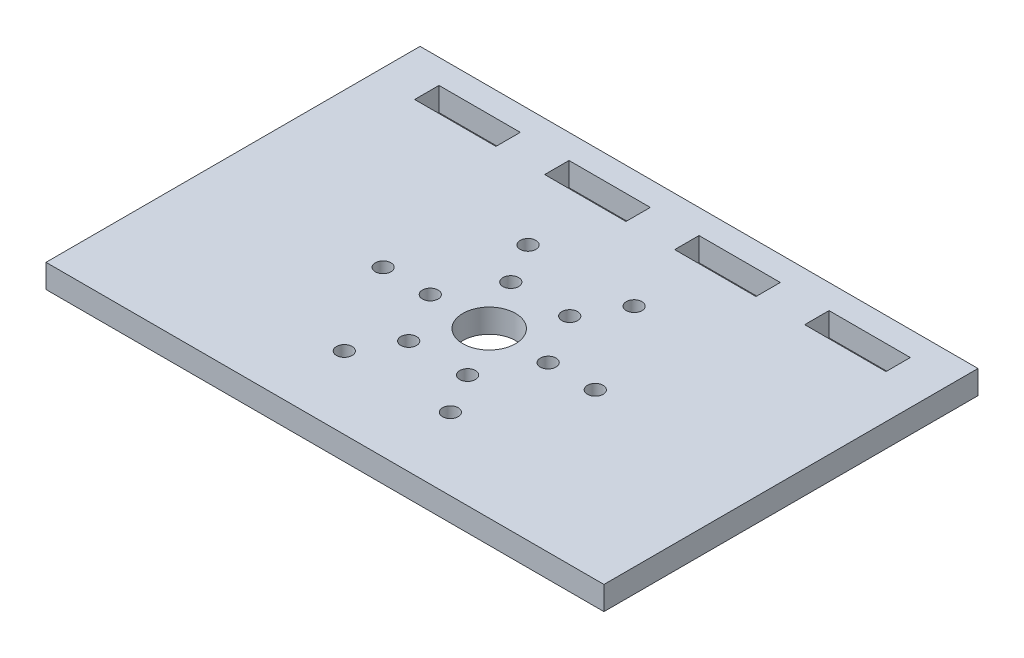
ISO-10303-21;
HEADER;
FILE_DESCRIPTION(('STEP AP214'),'2;1');
FILE_NAME('part.step','',(''),(''),'','','');
FILE_SCHEMA(('AUTOMOTIVE_DESIGN { 1 0 10303 214 1 1 1 1 }'));
ENDSEC;
DATA;
#1=APPLICATION_CONTEXT('core data for automotive mechanical design processes');
#2=APPLICATION_PROTOCOL_DEFINITION('international standard','automotive_design',2000,#1);
#3=PRODUCT_CONTEXT('',#1,'mechanical');
#4=PRODUCT('Part','Part','',(#3));
#5=PRODUCT_RELATED_PRODUCT_CATEGORY('part','',(#4));
#6=PRODUCT_DEFINITION_FORMATION('','',#4);
#7=PRODUCT_DEFINITION_CONTEXT('part definition',#1,'design');
#8=PRODUCT_DEFINITION('design','',#6,#7);
#9=PRODUCT_DEFINITION_SHAPE('','',#8);
#10=(LENGTH_UNIT() NAMED_UNIT(*) SI_UNIT(.MILLI.,.METRE.));
#11=(NAMED_UNIT(*) PLANE_ANGLE_UNIT() SI_UNIT($,.RADIAN.));
#12=(NAMED_UNIT(*) SI_UNIT($,.STERADIAN.) SOLID_ANGLE_UNIT());
#13=UNCERTAINTY_MEASURE_WITH_UNIT(LENGTH_MEASURE(1.E-05),#10,'distance_accuracy_value','');
#14=(GEOMETRIC_REPRESENTATION_CONTEXT(3) GLOBAL_UNCERTAINTY_ASSIGNED_CONTEXT((#13)) GLOBAL_UNIT_ASSIGNED_CONTEXT((#10,
#11,#12)) REPRESENTATION_CONTEXT('',''));
#15=CARTESIAN_POINT('',(0.,0.,0.));
#16=DIRECTION('',(0.,0.,1.));
#17=DIRECTION('',(1.,0.,0.));
#18=AXIS2_PLACEMENT_3D('',#15,#16,#17);
#19=CARTESIAN_POINT('',(0.,3.,-41.4));
#20=DIRECTION('',(0.,0.,1.));
#21=DIRECTION('',(1.,0.,0.));
#22=AXIS2_PLACEMENT_3D('',#19,#20,#21);
#23=PLANE('',#22);
#24=DIRECTION('',(-1.,0.,0.));
#25=VECTOR('',#24,1.);
#26=CARTESIAN_POINT('',(0.,0.,-41.4));
#27=LINE('',#26,#25);
#28=CARTESIAN_POINT('',(65.488,0.,-41.4));
#29=VERTEX_POINT('',#28);
#30=CARTESIAN_POINT('',(55.144,0.,-41.4));
#31=VERTEX_POINT('',#30);
#32=EDGE_CURVE('E283',#29,#31,#27,.T.);
#33=ORIENTED_EDGE('',*,*,#32,.T.);
#34=DIRECTION('',(0.,-1.,0.));
#35=VECTOR('',#34,1.);
#36=CARTESIAN_POINT('',(55.144,3.,-41.4));
#37=LINE('',#36,#35);
#38=CARTESIAN_POINT('',(55.144,3.,-41.4));
#39=VERTEX_POINT('',#38);
#40=EDGE_CURVE('E11',#39,#31,#37,.T.);
#41=ORIENTED_EDGE('',*,*,#40,.F.);
#42=DIRECTION('',(-1.,0.,0.));
#43=VECTOR('',#42,1.);
#44=CARTESIAN_POINT('',(0.,3.,-41.4));
#45=LINE('',#44,#43);
#46=CARTESIAN_POINT('',(65.488,3.,-41.4));
#47=VERTEX_POINT('',#46);
#48=EDGE_CURVE('E188',#47,#39,#45,.T.);
#49=ORIENTED_EDGE('',*,*,#48,.F.);
#50=DIRECTION('',(0.,-1.,0.));
#51=VECTOR('',#50,1.);
#52=CARTESIAN_POINT('',(65.488,3.,-41.4));
#53=LINE('',#52,#51);
#54=EDGE_CURVE('E290',#47,#29,#53,.T.);
#55=ORIENTED_EDGE('',*,*,#54,.T.);
#56=EDGE_LOOP('',(#33,#41,#49,#55));
#57=FACE_BOUND('',#56,.T.);
#58=ADVANCED_FACE('F35',(#57),#23,.F.);
#59=CARTESIAN_POINT('',(55.144,3.,0.));
#60=DIRECTION('',(-1.,0.,0.));
#61=DIRECTION('',(0.,0.,1.));
#62=AXIS2_PLACEMENT_3D('',#59,#60,#61);
#63=PLANE('',#62);
#64=DIRECTION('',(0.,0.,-1.));
#65=VECTOR('',#64,1.);
#66=CARTESIAN_POINT('',(55.144,0.,0.));
#67=LINE('',#66,#65);
#68=CARTESIAN_POINT('',(55.144,0.,-44.5));
#69=VERTEX_POINT('',#68);
#70=EDGE_CURVE('E193',#31,#69,#67,.T.);
#71=ORIENTED_EDGE('',*,*,#70,.T.);
#72=DIRECTION('',(0.,-1.,0.));
#73=VECTOR('',#72,1.);
#74=CARTESIAN_POINT('',(55.144,3.,-44.5));
#75=LINE('',#74,#73);
#76=CARTESIAN_POINT('',(55.144,3.,-44.5));
#77=VERTEX_POINT('',#76);
#78=EDGE_CURVE('E45',#77,#69,#75,.T.);
#79=ORIENTED_EDGE('',*,*,#78,.F.);
#80=DIRECTION('',(0.,0.,-1.));
#81=VECTOR('',#80,1.);
#82=CARTESIAN_POINT('',(55.144,3.,0.));
#83=LINE('',#82,#81);
#84=EDGE_CURVE('E182',#39,#77,#83,.T.);
#85=ORIENTED_EDGE('',*,*,#84,.F.);
#86=ORIENTED_EDGE('',*,*,#40,.T.);
#87=EDGE_LOOP('',(#71,#79,#85,#86));
#88=FACE_BOUND('',#87,.T.);
#89=ADVANCED_FACE('F192',(#88),#63,.F.);
#90=CARTESIAN_POINT('',(0.,3.,-44.5));
#91=DIRECTION('',(0.,0.,-1.));
#92=DIRECTION('',(-1.,0.,0.));
#93=AXIS2_PLACEMENT_3D('',#90,#91,#92);
#94=PLANE('',#93);
#95=DIRECTION('',(1.,0.,0.));
#96=VECTOR('',#95,1.);
#97=CARTESIAN_POINT('',(0.,0.,-44.5));
#98=LINE('',#97,#96);
#99=CARTESIAN_POINT('',(65.488,0.,-44.5));
#100=VERTEX_POINT('',#99);
#101=EDGE_CURVE('E119',#69,#100,#98,.T.);
#102=ORIENTED_EDGE('',*,*,#101,.T.);
#103=DIRECTION('',(0.,-1.,0.));
#104=VECTOR('',#103,1.);
#105=CARTESIAN_POINT('',(65.488,3.,-44.5));
#106=LINE('',#105,#104);
#107=CARTESIAN_POINT('',(65.488,3.,-44.5));
#108=VERTEX_POINT('',#107);
#109=EDGE_CURVE('E194',#108,#100,#106,.T.);
#110=ORIENTED_EDGE('',*,*,#109,.F.);
#111=DIRECTION('',(1.,0.,0.));
#112=VECTOR('',#111,1.);
#113=CARTESIAN_POINT('',(0.,3.,-44.5));
#114=LINE('',#113,#112);
#115=EDGE_CURVE('E186',#77,#108,#114,.T.);
#116=ORIENTED_EDGE('',*,*,#115,.F.);
#117=ORIENTED_EDGE('',*,*,#78,.T.);
#118=EDGE_LOOP('',(#102,#110,#116,#117));
#119=FACE_BOUND('',#118,.T.);
#120=ADVANCED_FACE('F196',(#119),#94,.F.);
#121=CARTESIAN_POINT('',(0.,3.,-41.4));
#122=DIRECTION('',(0.,0.,1.));
#123=DIRECTION('',(1.,0.,0.));
#124=AXIS2_PLACEMENT_3D('',#121,#122,#123);
#125=PLANE('',#124);
#126=DIRECTION('',(-1.,0.,0.));
#127=VECTOR('',#126,1.);
#128=CARTESIAN_POINT('',(0.,0.,-41.4));
#129=LINE('',#128,#127);
#130=CARTESIAN_POINT('',(48.944,0.,-41.4));
#131=VERTEX_POINT('',#130);
#132=CARTESIAN_POINT('',(38.6,0.,-41.4));
#133=VERTEX_POINT('',#132);
#134=EDGE_CURVE('E274',#131,#133,#129,.T.);
#135=ORIENTED_EDGE('',*,*,#134,.T.);
#136=DIRECTION('',(0.,-1.,0.));
#137=VECTOR('',#136,1.);
#138=CARTESIAN_POINT('',(38.6,3.,-41.4));
#139=LINE('',#138,#137);
#140=CARTESIAN_POINT('',(38.6,3.,-41.4));
#141=VERTEX_POINT('',#140);
#142=EDGE_CURVE('E292',#141,#133,#139,.T.);
#143=ORIENTED_EDGE('',*,*,#142,.F.);
#144=DIRECTION('',(-1.,0.,0.));
#145=VECTOR('',#144,1.);
#146=CARTESIAN_POINT('',(0.,3.,-41.4));
#147=LINE('',#146,#145);
#148=CARTESIAN_POINT('',(48.944,3.,-41.4));
#149=VERTEX_POINT('',#148);
#150=EDGE_CURVE('E745',#149,#141,#147,.T.);
#151=ORIENTED_EDGE('',*,*,#150,.F.);
#152=DIRECTION('',(0.,-1.,0.));
#153=VECTOR('',#152,1.);
#154=CARTESIAN_POINT('',(48.944,3.,-41.4));
#155=LINE('',#154,#153);
#156=EDGE_CURVE('E294',#149,#131,#155,.T.);
#157=ORIENTED_EDGE('',*,*,#156,.T.);
#158=EDGE_LOOP('',(#135,#143,#151,#157));
#159=FACE_BOUND('',#158,.T.);
#160=ADVANCED_FACE('F376',(#159),#125,.F.);
#161=CARTESIAN_POINT('',(38.6,3.,0.));
#162=DIRECTION('',(-1.,0.,0.));
#163=DIRECTION('',(0.,0.,1.));
#164=AXIS2_PLACEMENT_3D('',#161,#162,#163);
#165=PLANE('',#164);
#166=DIRECTION('',(0.,0.,-1.));
#167=VECTOR('',#166,1.);
#168=CARTESIAN_POINT('',(38.6,0.,0.));
#169=LINE('',#168,#167);
#170=CARTESIAN_POINT('',(38.6,0.,-44.5));
#171=VERTEX_POINT('',#170);
#172=EDGE_CURVE('E277',#133,#171,#169,.T.);
#173=ORIENTED_EDGE('',*,*,#172,.T.);
#174=DIRECTION('',(0.,-1.,0.));
#175=VECTOR('',#174,1.);
#176=CARTESIAN_POINT('',(38.6,3.,-44.5));
#177=LINE('',#176,#175);
#178=CARTESIAN_POINT('',(38.6,3.,-44.5));
#179=VERTEX_POINT('',#178);
#180=EDGE_CURVE('E301',#179,#171,#177,.T.);
#181=ORIENTED_EDGE('',*,*,#180,.F.);
#182=DIRECTION('',(0.,0.,-1.));
#183=VECTOR('',#182,1.);
#184=CARTESIAN_POINT('',(38.6,3.,0.));
#185=LINE('',#184,#183);
#186=EDGE_CURVE('E747',#141,#179,#185,.T.);
#187=ORIENTED_EDGE('',*,*,#186,.F.);
#188=ORIENTED_EDGE('',*,*,#142,.T.);
#189=EDGE_LOOP('',(#173,#181,#187,#188));
#190=FACE_BOUND('',#189,.T.);
#191=ADVANCED_FACE('F372',(#190),#165,.F.);
#192=CARTESIAN_POINT('',(0.,3.,-44.5));
#193=DIRECTION('',(0.,0.,-1.));
#194=DIRECTION('',(-1.,0.,0.));
#195=AXIS2_PLACEMENT_3D('',#192,#193,#194);
#196=PLANE('',#195);
#197=DIRECTION('',(1.,0.,0.));
#198=VECTOR('',#197,1.);
#199=CARTESIAN_POINT('',(0.,0.,-44.5));
#200=LINE('',#199,#198);
#201=CARTESIAN_POINT('',(48.944,0.,-44.5));
#202=VERTEX_POINT('',#201);
#203=EDGE_CURVE('E279',#171,#202,#200,.T.);
#204=ORIENTED_EDGE('',*,*,#203,.T.);
#205=DIRECTION('',(0.,-1.,0.));
#206=VECTOR('',#205,1.);
#207=CARTESIAN_POINT('',(48.944,3.,-44.5));
#208=LINE('',#207,#206);
#209=CARTESIAN_POINT('',(48.944,3.,-44.5));
#210=VERTEX_POINT('',#209);
#211=EDGE_CURVE('E297',#210,#202,#208,.T.);
#212=ORIENTED_EDGE('',*,*,#211,.F.);
#213=DIRECTION('',(1.,0.,0.));
#214=VECTOR('',#213,1.);
#215=CARTESIAN_POINT('',(0.,3.,-44.5));
#216=LINE('',#215,#214);
#217=EDGE_CURVE('E756',#179,#210,#216,.T.);
#218=ORIENTED_EDGE('',*,*,#217,.F.);
#219=ORIENTED_EDGE('',*,*,#180,.T.);
#220=EDGE_LOOP('',(#204,#212,#218,#219));
#221=FACE_BOUND('',#220,.T.);
#222=ADVANCED_FACE('F368',(#221),#196,.F.);
#223=CARTESIAN_POINT('',(0.,3.,-47.6));
#224=DIRECTION('',(0.,0.,1.));
#225=DIRECTION('',(1.,0.,0.));
#226=AXIS2_PLACEMENT_3D('',#223,#224,#225);
#227=PLANE('',#226);
#228=DIRECTION('',(-1.,0.,0.));
#229=VECTOR('',#228,1.);
#230=CARTESIAN_POINT('',(0.,0.,-47.6));
#231=LINE('',#230,#229);
#232=CARTESIAN_POINT('',(71.,0.,-47.6));
#233=VERTEX_POINT('',#232);
#234=CARTESIAN_POINT('',(0.,0.,-47.6));
#235=VERTEX_POINT('',#234);
#236=EDGE_CURVE('E265',#233,#235,#231,.T.);
#237=ORIENTED_EDGE('',*,*,#236,.T.);
#238=DIRECTION('',(0.,-1.,0.));
#239=VECTOR('',#238,1.);
#240=CARTESIAN_POINT('',(0.,3.,-47.6));
#241=LINE('',#240,#239);
#242=CARTESIAN_POINT('',(0.,3.,-47.6));
#243=VERTEX_POINT('',#242);
#244=EDGE_CURVE('E298',#243,#235,#241,.T.);
#245=ORIENTED_EDGE('',*,*,#244,.F.);
#246=DIRECTION('',(-1.,0.,0.));
#247=VECTOR('',#246,1.);
#248=CARTESIAN_POINT('',(0.,3.,-47.6));
#249=LINE('',#248,#247);
#250=CARTESIAN_POINT('',(71.,3.,-47.6));
#251=VERTEX_POINT('',#250);
#252=EDGE_CURVE('E741',#251,#243,#249,.T.);
#253=ORIENTED_EDGE('',*,*,#252,.F.);
#254=DIRECTION('',(0.,-1.,0.));
#255=VECTOR('',#254,1.);
#256=CARTESIAN_POINT('',(71.,3.,-47.6));
#257=LINE('',#256,#255);
#258=EDGE_CURVE('E306',#251,#233,#257,.T.);
#259=ORIENTED_EDGE('',*,*,#258,.T.);
#260=EDGE_LOOP('',(#237,#245,#253,#259));
#261=FACE_BOUND('',#260,.T.);
#262=ADVANCED_FACE('F371',(#261),#227,.F.);
#263=CARTESIAN_POINT('',(0.,3.,0.));
#264=DIRECTION('',(1.,0.,0.));
#265=DIRECTION('',(0.,0.,-1.));
#266=AXIS2_PLACEMENT_3D('',#263,#264,#265);
#267=PLANE('',#266);
#268=DIRECTION('',(0.,0.,1.));
#269=VECTOR('',#268,1.);
#270=CARTESIAN_POINT('',(0.,0.,0.));
#271=LINE('',#270,#269);
#272=CARTESIAN_POINT('',(0.,0.,0.));
#273=VERTEX_POINT('',#272);
#274=EDGE_CURVE('E268',#235,#273,#271,.T.);
#275=ORIENTED_EDGE('',*,*,#274,.T.);
#276=DIRECTION('',(0.,-1.,0.));
#277=VECTOR('',#276,1.);
#278=CARTESIAN_POINT('',(0.,3.,0.));
#279=LINE('',#278,#277);
#280=CARTESIAN_POINT('',(0.,3.,0.));
#281=VERTEX_POINT('',#280);
#282=EDGE_CURVE('E313',#281,#273,#279,.T.);
#283=ORIENTED_EDGE('',*,*,#282,.F.);
#284=DIRECTION('',(0.,0.,1.));
#285=VECTOR('',#284,1.);
#286=CARTESIAN_POINT('',(0.,3.,0.));
#287=LINE('',#286,#285);
#288=EDGE_CURVE('E764',#243,#281,#287,.T.);
#289=ORIENTED_EDGE('',*,*,#288,.F.);
#290=ORIENTED_EDGE('',*,*,#244,.T.);
#291=EDGE_LOOP('',(#275,#283,#289,#290));
#292=FACE_BOUND('',#291,.T.);
#293=ADVANCED_FACE('F389',(#292),#267,.F.);
#294=CARTESIAN_POINT('',(0.,3.,0.));
#295=DIRECTION('',(0.,0.,-1.));
#296=DIRECTION('',(-1.,0.,0.));
#297=AXIS2_PLACEMENT_3D('',#294,#295,#296);
#298=PLANE('',#297);
#299=DIRECTION('',(1.,0.,0.));
#300=VECTOR('',#299,1.);
#301=CARTESIAN_POINT('',(0.,0.,0.));
#302=LINE('',#301,#300);
#303=CARTESIAN_POINT('',(71.,0.,0.));
#304=VERTEX_POINT('',#303);
#305=EDGE_CURVE('E270',#273,#304,#302,.T.);
#306=ORIENTED_EDGE('',*,*,#305,.T.);
#307=DIRECTION('',(0.,-1.,0.));
#308=VECTOR('',#307,1.);
#309=CARTESIAN_POINT('',(71.,3.,0.));
#310=LINE('',#309,#308);
#311=CARTESIAN_POINT('',(71.,3.,0.));
#312=VERTEX_POINT('',#311);
#313=EDGE_CURVE('E309',#312,#304,#310,.T.);
#314=ORIENTED_EDGE('',*,*,#313,.F.);
#315=DIRECTION('',(1.,0.,0.));
#316=VECTOR('',#315,1.);
#317=CARTESIAN_POINT('',(0.,3.,0.));
#318=LINE('',#317,#316);
#319=EDGE_CURVE('E762',#281,#312,#318,.T.);
#320=ORIENTED_EDGE('',*,*,#319,.F.);
#321=ORIENTED_EDGE('',*,*,#282,.T.);
#322=EDGE_LOOP('',(#306,#314,#320,#321));
#323=FACE_BOUND('',#322,.T.);
#324=ADVANCED_FACE('F385',(#323),#298,.F.);
#325=CARTESIAN_POINT('',(32.4,3.,0.));
#326=DIRECTION('',(-1.,0.,0.));
#327=DIRECTION('',(0.,0.,1.));
#328=AXIS2_PLACEMENT_3D('',#325,#326,#327);
#329=PLANE('',#328);
#330=DIRECTION('',(0.,0.,-1.));
#331=VECTOR('',#330,1.);
#332=CARTESIAN_POINT('',(32.4,0.,0.));
#333=LINE('',#332,#331);
#334=CARTESIAN_POINT('',(32.4,0.,-41.4));
#335=VERTEX_POINT('',#334);
#336=CARTESIAN_POINT('',(32.4,0.,-44.5));
#337=VERTEX_POINT('',#336);
#338=EDGE_CURVE('E253',#335,#337,#333,.T.);
#339=ORIENTED_EDGE('',*,*,#338,.F.);
#340=DIRECTION('',(0.,-1.,0.));
#341=VECTOR('',#340,1.);
#342=CARTESIAN_POINT('',(32.4,3.,-41.4));
#343=LINE('',#342,#341);
#344=CARTESIAN_POINT('',(32.4,3.,-41.4));
#345=VERTEX_POINT('',#344);
#346=EDGE_CURVE('E310',#345,#335,#343,.T.);
#347=ORIENTED_EDGE('',*,*,#346,.F.);
#348=DIRECTION('',(0.,0.,-1.));
#349=VECTOR('',#348,1.);
#350=CARTESIAN_POINT('',(32.4,3.,0.));
#351=LINE('',#350,#349);
#352=CARTESIAN_POINT('',(32.4,3.,-44.5));
#353=VERTEX_POINT('',#352);
#354=EDGE_CURVE('E736',#345,#353,#351,.T.);
#355=ORIENTED_EDGE('',*,*,#354,.T.);
#356=DIRECTION('',(0.,-1.,0.));
#357=VECTOR('',#356,1.);
#358=CARTESIAN_POINT('',(32.4,3.,-44.5));
#359=LINE('',#358,#357);
#360=EDGE_CURVE('E318',#353,#337,#359,.T.);
#361=ORIENTED_EDGE('',*,*,#360,.T.);
#362=EDGE_LOOP('',(#339,#347,#355,#361));
#363=FACE_BOUND('',#362,.T.);
#364=ADVANCED_FACE('F388',(#363),#329,.T.);
#365=CARTESIAN_POINT('',(0.,3.,-41.4));
#366=DIRECTION('',(0.,0.,-1.));
#367=DIRECTION('',(-1.,0.,0.));
#368=AXIS2_PLACEMENT_3D('',#365,#366,#367);
#369=PLANE('',#368);
#370=DIRECTION('',(1.,0.,0.));
#371=VECTOR('',#370,1.);
#372=CARTESIAN_POINT('',(0.,0.,-41.4));
#373=LINE('',#372,#371);
#374=CARTESIAN_POINT('',(22.056,0.,-41.4));
#375=VERTEX_POINT('',#374);
#376=EDGE_CURVE('E256',#375,#335,#373,.T.);
#377=ORIENTED_EDGE('',*,*,#376,.F.);
#378=DIRECTION('',(0.,-1.,0.));
#379=VECTOR('',#378,1.);
#380=CARTESIAN_POINT('',(22.056,3.,-41.4));
#381=LINE('',#380,#379);
#382=CARTESIAN_POINT('',(22.056,3.,-41.4));
#383=VERTEX_POINT('',#382);
#384=EDGE_CURVE('E322',#383,#375,#381,.T.);
#385=ORIENTED_EDGE('',*,*,#384,.F.);
#386=DIRECTION('',(1.,0.,0.));
#387=VECTOR('',#386,1.);
#388=CARTESIAN_POINT('',(0.,3.,-41.4));
#389=LINE('',#388,#387);
#390=EDGE_CURVE('E772',#383,#345,#389,.T.);
#391=ORIENTED_EDGE('',*,*,#390,.T.);
#392=ORIENTED_EDGE('',*,*,#346,.T.);
#393=EDGE_LOOP('',(#377,#385,#391,#392));
#394=FACE_BOUND('',#393,.T.);
#395=ADVANCED_FACE('F404',(#394),#369,.T.);
#396=CARTESIAN_POINT('',(22.056,3.,0.));
#397=DIRECTION('',(1.,0.,0.));
#398=DIRECTION('',(0.,0.,-1.));
#399=AXIS2_PLACEMENT_3D('',#396,#397,#398);
#400=PLANE('',#399);
#401=DIRECTION('',(0.,0.,1.));
#402=VECTOR('',#401,1.);
#403=CARTESIAN_POINT('',(22.056,0.,0.));
#404=LINE('',#403,#402);
#405=CARTESIAN_POINT('',(22.056,0.,-44.5));
#406=VERTEX_POINT('',#405);
#407=EDGE_CURVE('E259',#406,#375,#404,.T.);
#408=ORIENTED_EDGE('',*,*,#407,.F.);
#409=DIRECTION('',(0.,-1.,0.));
#410=VECTOR('',#409,1.);
#411=CARTESIAN_POINT('',(22.056,3.,-44.5));
#412=LINE('',#411,#410);
#413=CARTESIAN_POINT('',(22.056,3.,-44.5));
#414=VERTEX_POINT('',#413);
#415=EDGE_CURVE('E320',#414,#406,#412,.T.);
#416=ORIENTED_EDGE('',*,*,#415,.F.);
#417=DIRECTION('',(0.,0.,1.));
#418=VECTOR('',#417,1.);
#419=CARTESIAN_POINT('',(22.056,3.,0.));
#420=LINE('',#419,#418);
#421=EDGE_CURVE('E769',#414,#383,#420,.T.);
#422=ORIENTED_EDGE('',*,*,#421,.T.);
#423=ORIENTED_EDGE('',*,*,#384,.T.);
#424=EDGE_LOOP('',(#408,#416,#422,#423));
#425=FACE_BOUND('',#424,.T.);
#426=ADVANCED_FACE('F401',(#425),#400,.T.);
#427=CARTESIAN_POINT('',(5.51200000000001,3.,0.));
#428=DIRECTION('',(1.,0.,0.));
#429=DIRECTION('',(0.,0.,-1.));
#430=AXIS2_PLACEMENT_3D('',#427,#428,#429);
#431=PLANE('',#430);
#432=DIRECTION('',(0.,0.,1.));
#433=VECTOR('',#432,1.);
#434=CARTESIAN_POINT('',(5.51200000000001,0.,0.));
#435=LINE('',#434,#433);
#436=CARTESIAN_POINT('',(5.512,0.,-44.5));
#437=VERTEX_POINT('',#436);
#438=CARTESIAN_POINT('',(5.512,0.,-41.4));
#439=VERTEX_POINT('',#438);
#440=EDGE_CURVE('E202',#437,#439,#435,.T.);
#441=ORIENTED_EDGE('',*,*,#440,.F.);
#442=DIRECTION('',(0.,-1.,0.));
#443=VECTOR('',#442,1.);
#444=CARTESIAN_POINT('',(5.512,3.,-44.5));
#445=LINE('',#444,#443);
#446=CARTESIAN_POINT('',(5.512,3.,-44.5));
#447=VERTEX_POINT('',#446);
#448=EDGE_CURVE('E39',#447,#437,#445,.T.);
#449=ORIENTED_EDGE('',*,*,#448,.F.);
#450=DIRECTION('',(0.,0.,1.));
#451=VECTOR('',#450,1.);
#452=CARTESIAN_POINT('',(5.51200000000001,3.,0.));
#453=LINE('',#452,#451);
#454=CARTESIAN_POINT('',(5.512,3.,-41.4));
#455=VERTEX_POINT('',#454);
#456=EDGE_CURVE('E289',#447,#455,#453,.T.);
#457=ORIENTED_EDGE('',*,*,#456,.T.);
#458=DIRECTION('',(0.,-1.,0.));
#459=VECTOR('',#458,1.);
#460=CARTESIAN_POINT('',(5.512,3.,-41.4));
#461=LINE('',#460,#459);
#462=EDGE_CURVE('E198',#455,#439,#461,.T.);
#463=ORIENTED_EDGE('',*,*,#462,.T.);
#464=EDGE_LOOP('',(#441,#449,#457,#463));
#465=FACE_BOUND('',#464,.T.);
#466=ADVANCED_FACE('F37',(#465),#431,.T.);
#467=CARTESIAN_POINT('',(0.,3.,-44.5));
#468=DIRECTION('',(0.,0.,-1.));
#469=DIRECTION('',(-1.,0.,0.));
#470=AXIS2_PLACEMENT_3D('',#467,#468,#469);
#471=PLANE('',#470);
#472=DIRECTION('',(1.,0.,0.));
#473=VECTOR('',#472,1.);
#474=CARTESIAN_POINT('',(0.,0.,-44.5));
#475=LINE('',#474,#473);
#476=CARTESIAN_POINT('',(15.856,0.,-44.5));
#477=VERTEX_POINT('',#476);
#478=EDGE_CURVE('E205',#437,#477,#475,.T.);
#479=ORIENTED_EDGE('',*,*,#478,.T.);
#480=DIRECTION('',(0.,-1.,0.));
#481=VECTOR('',#480,1.);
#482=CARTESIAN_POINT('',(15.856,3.,-44.5));
#483=LINE('',#482,#481);
#484=CARTESIAN_POINT('',(15.856,3.,-44.5));
#485=VERTEX_POINT('',#484);
#486=EDGE_CURVE('E327',#485,#477,#483,.T.);
#487=ORIENTED_EDGE('',*,*,#486,.F.);
#488=DIRECTION('',(1.,0.,0.));
#489=VECTOR('',#488,1.);
#490=CARTESIAN_POINT('',(0.,3.,-44.5));
#491=LINE('',#490,#489);
#492=EDGE_CURVE('E335',#447,#485,#491,.T.);
#493=ORIENTED_EDGE('',*,*,#492,.F.);
#494=ORIENTED_EDGE('',*,*,#448,.T.);
#495=EDGE_LOOP('',(#479,#487,#493,#494));
#496=FACE_BOUND('',#495,.T.);
#497=ADVANCED_FACE('F334',(#496),#471,.F.);
#498=CARTESIAN_POINT('',(15.856,3.,0.));
#499=DIRECTION('',(-1.,0.,0.));
#500=DIRECTION('',(0.,0.,1.));
#501=AXIS2_PLACEMENT_3D('',#498,#499,#500);
#502=PLANE('',#501);
#503=DIRECTION('',(0.,0.,-1.));
#504=VECTOR('',#503,1.);
#505=CARTESIAN_POINT('',(15.856,0.,0.));
#506=LINE('',#505,#504);
#507=CARTESIAN_POINT('',(15.856,0.,-41.4));
#508=VERTEX_POINT('',#507);
#509=EDGE_CURVE('E208',#508,#477,#506,.T.);
#510=ORIENTED_EDGE('',*,*,#509,.F.);
#511=DIRECTION('',(0.,-1.,0.));
#512=VECTOR('',#511,1.);
#513=CARTESIAN_POINT('',(15.856,3.,-41.4));
#514=LINE('',#513,#512);
#515=CARTESIAN_POINT('',(15.856,3.,-41.4));
#516=VERTEX_POINT('',#515);
#517=EDGE_CURVE('E326',#516,#508,#514,.T.);
#518=ORIENTED_EDGE('',*,*,#517,.F.);
#519=DIRECTION('',(0.,0.,-1.));
#520=VECTOR('',#519,1.);
#521=CARTESIAN_POINT('',(15.856,3.,0.));
#522=LINE('',#521,#520);
#523=EDGE_CURVE('E789',#516,#485,#522,.T.);
#524=ORIENTED_EDGE('',*,*,#523,.T.);
#525=ORIENTED_EDGE('',*,*,#486,.T.);
#526=EDGE_LOOP('',(#510,#518,#524,#525));
#527=FACE_BOUND('',#526,.T.);
#528=ADVANCED_FACE('F347',(#527),#502,.T.);
#529=CARTESIAN_POINT('',(48.944,3.,0.));
#530=DIRECTION('',(1.,0.,0.));
#531=DIRECTION('',(0.,0.,-1.));
#532=AXIS2_PLACEMENT_3D('',#529,#530,#531);
#533=PLANE('',#532);
#534=DIRECTION('',(0.,0.,1.));
#535=VECTOR('',#534,1.);
#536=CARTESIAN_POINT('',(48.944,0.,0.));
#537=LINE('',#536,#535);
#538=EDGE_CURVE('E281',#202,#131,#537,.T.);
#539=ORIENTED_EDGE('',*,*,#538,.T.);
#540=ORIENTED_EDGE('',*,*,#156,.F.);
#541=DIRECTION('',(0.,0.,1.));
#542=VECTOR('',#541,1.);
#543=CARTESIAN_POINT('',(48.944,3.,0.));
#544=LINE('',#543,#542);
#545=EDGE_CURVE('E750',#210,#149,#544,.T.);
#546=ORIENTED_EDGE('',*,*,#545,.F.);
#547=ORIENTED_EDGE('',*,*,#211,.T.);
#548=EDGE_LOOP('',(#539,#540,#546,#547));
#549=FACE_BOUND('',#548,.T.);
#550=ADVANCED_FACE('F349',(#549),#533,.F.);
#551=CARTESIAN_POINT('',(71.,3.,0.));
#552=DIRECTION('',(-1.,0.,0.));
#553=DIRECTION('',(0.,0.,1.));
#554=AXIS2_PLACEMENT_3D('',#551,#552,#553);
#555=PLANE('',#554);
#556=DIRECTION('',(0.,0.,-1.));
#557=VECTOR('',#556,1.);
#558=CARTESIAN_POINT('',(71.,0.,0.));
#559=LINE('',#558,#557);
#560=EDGE_CURVE('E272',#304,#233,#559,.T.);
#561=ORIENTED_EDGE('',*,*,#560,.T.);
#562=ORIENTED_EDGE('',*,*,#258,.F.);
#563=DIRECTION('',(0.,0.,-1.));
#564=VECTOR('',#563,1.);
#565=CARTESIAN_POINT('',(71.,3.,0.));
#566=LINE('',#565,#564);
#567=EDGE_CURVE('E752',#312,#251,#566,.T.);
#568=ORIENTED_EDGE('',*,*,#567,.F.);
#569=ORIENTED_EDGE('',*,*,#313,.T.);
#570=EDGE_LOOP('',(#561,#562,#568,#569));
#571=FACE_BOUND('',#570,.T.);
#572=ADVANCED_FACE('F355',(#571),#555,.F.);
#573=CARTESIAN_POINT('',(0.,3.,-44.5));
#574=DIRECTION('',(0.,0.,-1.));
#575=DIRECTION('',(-1.,0.,0.));
#576=AXIS2_PLACEMENT_3D('',#573,#574,#575);
#577=PLANE('',#576);
#578=DIRECTION('',(1.,0.,0.));
#579=VECTOR('',#578,1.);
#580=CARTESIAN_POINT('',(0.,0.,-44.5));
#581=LINE('',#580,#579);
#582=EDGE_CURVE('E262',#406,#337,#581,.T.);
#583=ORIENTED_EDGE('',*,*,#582,.T.);
#584=ORIENTED_EDGE('',*,*,#360,.F.);
#585=DIRECTION('',(1.,0.,0.));
#586=VECTOR('',#585,1.);
#587=CARTESIAN_POINT('',(0.,3.,-44.5));
#588=LINE('',#587,#586);
#589=EDGE_CURVE('E767',#414,#353,#588,.T.);
#590=ORIENTED_EDGE('',*,*,#589,.F.);
#591=ORIENTED_EDGE('',*,*,#415,.T.);
#592=EDGE_LOOP('',(#583,#584,#590,#591));
#593=FACE_BOUND('',#592,.T.);
#594=ADVANCED_FACE('F383',(#593),#577,.F.);
#595=CARTESIAN_POINT('',(35.5,3.,-20.9));
#596=DIRECTION('',(0.,-1.,0.));
#597=DIRECTION('',(0.,0.,-1.));
#598=AXIS2_PLACEMENT_3D('',#595,#596,#597);
#599=CYLINDRICAL_SURFACE('',#598,3.35);
#600=CARTESIAN_POINT('',(35.5,3.,-20.9));
#601=DIRECTION('',(0.,1.,0.));
#602=DIRECTION('',(0.,0.,1.));
#603=AXIS2_PLACEMENT_3D('',#600,#601,#602);
#604=CIRCLE('',#603,3.35);
#605=CARTESIAN_POINT('',(35.5,3.,-17.55));
#606=VERTEX_POINT('',#605);
#607=EDGE_CURVE('E731',#606,#606,#604,.T.);
#608=ORIENTED_EDGE('',*,*,#607,.T.);
#609=EDGE_LOOP('',(#608));
#610=FACE_BOUND('',#609,.T.);
#611=CARTESIAN_POINT('',(35.5,0.,-20.9));
#612=DIRECTION('',(0.,1.,0.));
#613=DIRECTION('',(0.,0.,1.));
#614=AXIS2_PLACEMENT_3D('',#611,#612,#613);
#615=CIRCLE('',#614,3.35);
#616=CARTESIAN_POINT('',(35.5,0.,-17.55));
#617=VERTEX_POINT('',#616);
#618=EDGE_CURVE('E250',#617,#617,#615,.T.);
#619=ORIENTED_EDGE('',*,*,#618,.F.);
#620=EDGE_LOOP('',(#619));
#621=FACE_BOUND('',#620,.T.);
#622=ADVANCED_FACE('F399',(#610,#621),#599,.F.);
#623=CARTESIAN_POINT('',(43.,3.,-20.9));
#624=DIRECTION('',(0.,-1.,0.));
#625=DIRECTION('',(0.,0.,-1.));
#626=AXIS2_PLACEMENT_3D('',#623,#624,#625);
#627=CYLINDRICAL_SURFACE('',#626,0.999999999999998);
#628=CARTESIAN_POINT('',(43.,3.,-20.9));
#629=DIRECTION('',(0.,1.,0.));
#630=DIRECTION('',(0.,0.,1.));
#631=AXIS2_PLACEMENT_3D('',#628,#629,#630);
#632=CIRCLE('',#631,0.999999999999998);
#633=CARTESIAN_POINT('',(43.,3.,-19.9));
#634=VERTEX_POINT('',#633);
#635=EDGE_CURVE('E727',#634,#634,#632,.T.);
#636=ORIENTED_EDGE('',*,*,#635,.T.);
#637=EDGE_LOOP('',(#636));
#638=FACE_BOUND('',#637,.T.);
#639=CARTESIAN_POINT('',(43.,0.,-20.9));
#640=DIRECTION('',(0.,1.,0.));
#641=DIRECTION('',(0.,0.,1.));
#642=AXIS2_PLACEMENT_3D('',#639,#640,#641);
#643=CIRCLE('',#642,0.999999999999998);
#644=CARTESIAN_POINT('',(43.,0.,-19.9));
#645=VERTEX_POINT('',#644);
#646=EDGE_CURVE('E247',#645,#645,#643,.T.);
#647=ORIENTED_EDGE('',*,*,#646,.F.);
#648=EDGE_LOOP('',(#647));
#649=FACE_BOUND('',#648,.T.);
#650=ADVANCED_FACE('F414',(#638,#649),#627,.F.);
#651=CARTESIAN_POINT('',(49.,3.,-20.9));
#652=DIRECTION('',(0.,-1.,0.));
#653=DIRECTION('',(0.,0.,-1.));
#654=AXIS2_PLACEMENT_3D('',#651,#652,#653);
#655=CYLINDRICAL_SURFACE('',#654,0.999999999999998);
#656=CARTESIAN_POINT('',(49.,3.,-20.9));
#657=DIRECTION('',(0.,1.,0.));
#658=DIRECTION('',(0.,0.,1.));
#659=AXIS2_PLACEMENT_3D('',#656,#657,#658);
#660=CIRCLE('',#659,0.999999999999998);
#661=CARTESIAN_POINT('',(49.,3.,-19.9));
#662=VERTEX_POINT('',#661);
#663=EDGE_CURVE('E723',#662,#662,#660,.T.);
#664=ORIENTED_EDGE('',*,*,#663,.T.);
#665=EDGE_LOOP('',(#664));
#666=FACE_BOUND('',#665,.T.);
#667=CARTESIAN_POINT('',(49.,0.,-20.9));
#668=DIRECTION('',(0.,1.,0.));
#669=DIRECTION('',(0.,0.,1.));
#670=AXIS2_PLACEMENT_3D('',#667,#668,#669);
#671=CIRCLE('',#670,0.999999999999998);
#672=CARTESIAN_POINT('',(49.,0.,-19.9));
#673=VERTEX_POINT('',#672);
#674=EDGE_CURVE('E244',#673,#673,#671,.T.);
#675=ORIENTED_EDGE('',*,*,#674,.F.);
#676=EDGE_LOOP('',(#675));
#677=FACE_BOUND('',#676,.T.);
#678=ADVANCED_FACE('F418',(#666,#677),#655,.F.);
#679=CARTESIAN_POINT('',(39.25,3.,-14.4048094716167));
#680=DIRECTION('',(0.,-1.,0.));
#681=DIRECTION('',(0.,0.,-1.));
#682=AXIS2_PLACEMENT_3D('',#679,#680,#681);
#683=CYLINDRICAL_SURFACE('',#682,0.999999999999998);
#684=CARTESIAN_POINT('',(39.25,3.,-14.4048094716167));
#685=DIRECTION('',(0.,1.,0.));
#686=DIRECTION('',(0.,0.,1.));
#687=AXIS2_PLACEMENT_3D('',#684,#685,#686);
#688=CIRCLE('',#687,0.999999999999998);
#689=CARTESIAN_POINT('',(39.25,3.,-13.4048094716167));
#690=VERTEX_POINT('',#689);
#691=EDGE_CURVE('E719',#690,#690,#688,.T.);
#692=ORIENTED_EDGE('',*,*,#691,.T.);
#693=EDGE_LOOP('',(#692));
#694=FACE_BOUND('',#693,.T.);
#695=CARTESIAN_POINT('',(39.25,0.,-14.4048094716167));
#696=DIRECTION('',(0.,1.,0.));
#697=DIRECTION('',(0.,0.,1.));
#698=AXIS2_PLACEMENT_3D('',#695,#696,#697);
#699=CIRCLE('',#698,0.999999999999998);
#700=CARTESIAN_POINT('',(39.25,0.,-13.4048094716167));
#701=VERTEX_POINT('',#700);
#702=EDGE_CURVE('E241',#701,#701,#699,.T.);
#703=ORIENTED_EDGE('',*,*,#702,.F.);
#704=EDGE_LOOP('',(#703));
#705=FACE_BOUND('',#704,.T.);
#706=ADVANCED_FACE('F422',(#694,#705),#683,.F.);
#707=CARTESIAN_POINT('',(42.25,3.,-9.20865704891007));
#708=DIRECTION('',(0.,-1.,0.));
#709=DIRECTION('',(0.,0.,-1.));
#710=AXIS2_PLACEMENT_3D('',#707,#708,#709);
#711=CYLINDRICAL_SURFACE('',#710,0.999999999999993);
#712=CARTESIAN_POINT('',(42.25,3.,-9.20865704891007));
#713=DIRECTION('',(0.,1.,0.));
#714=DIRECTION('',(0.,0.,1.));
#715=AXIS2_PLACEMENT_3D('',#712,#713,#714);
#716=CIRCLE('',#715,0.999999999999993);
#717=CARTESIAN_POINT('',(42.25,3.,-8.20865704891007));
#718=VERTEX_POINT('',#717);
#719=EDGE_CURVE('E715',#718,#718,#716,.T.);
#720=ORIENTED_EDGE('',*,*,#719,.T.);
#721=EDGE_LOOP('',(#720));
#722=FACE_BOUND('',#721,.T.);
#723=CARTESIAN_POINT('',(42.25,0.,-9.20865704891007));
#724=DIRECTION('',(0.,1.,0.));
#725=DIRECTION('',(0.,0.,1.));
#726=AXIS2_PLACEMENT_3D('',#723,#724,#725);
#727=CIRCLE('',#726,0.999999999999993);
#728=CARTESIAN_POINT('',(42.25,0.,-8.20865704891007));
#729=VERTEX_POINT('',#728);
#730=EDGE_CURVE('E238',#729,#729,#727,.T.);
#731=ORIENTED_EDGE('',*,*,#730,.F.);
#732=EDGE_LOOP('',(#731));
#733=FACE_BOUND('',#732,.T.);
#734=ADVANCED_FACE('F426',(#722,#733),#711,.F.);
#735=CARTESIAN_POINT('',(31.75,3.,-14.4048094716167));
#736=DIRECTION('',(0.,-1.,0.));
#737=DIRECTION('',(0.,0.,-1.));
#738=AXIS2_PLACEMENT_3D('',#735,#736,#737);
#739=CYLINDRICAL_SURFACE('',#738,0.999999999999999);
#740=CARTESIAN_POINT('',(31.75,3.,-14.4048094716167));
#741=DIRECTION('',(0.,1.,0.));
#742=DIRECTION('',(0.,0.,1.));
#743=AXIS2_PLACEMENT_3D('',#740,#741,#742);
#744=CIRCLE('',#743,0.999999999999999);
#745=CARTESIAN_POINT('',(31.75,3.,-13.4048094716167));
#746=VERTEX_POINT('',#745);
#747=EDGE_CURVE('E711',#746,#746,#744,.T.);
#748=ORIENTED_EDGE('',*,*,#747,.T.);
#749=EDGE_LOOP('',(#748));
#750=FACE_BOUND('',#749,.T.);
#751=CARTESIAN_POINT('',(31.75,0.,-14.4048094716167));
#752=DIRECTION('',(0.,1.,0.));
#753=DIRECTION('',(0.,0.,1.));
#754=AXIS2_PLACEMENT_3D('',#751,#752,#753);
#755=CIRCLE('',#754,0.999999999999999);
#756=CARTESIAN_POINT('',(31.75,0.,-13.4048094716167));
#757=VERTEX_POINT('',#756);
#758=EDGE_CURVE('E235',#757,#757,#755,.T.);
#759=ORIENTED_EDGE('',*,*,#758,.F.);
#760=EDGE_LOOP('',(#759));
#761=FACE_BOUND('',#760,.T.);
#762=ADVANCED_FACE('F430',(#750,#761),#739,.F.);
#763=CARTESIAN_POINT('',(28.75,3.,-9.2086570489101));
#764=DIRECTION('',(0.,-1.,0.));
#765=DIRECTION('',(0.,0.,-1.));
#766=AXIS2_PLACEMENT_3D('',#763,#764,#765);
#767=CYLINDRICAL_SURFACE('',#766,0.999999999999994);
#768=CARTESIAN_POINT('',(28.75,3.,-9.2086570489101));
#769=DIRECTION('',(0.,1.,0.));
#770=DIRECTION('',(0.,0.,1.));
#771=AXIS2_PLACEMENT_3D('',#768,#769,#770);
#772=CIRCLE('',#771,0.999999999999994);
#773=CARTESIAN_POINT('',(28.75,3.,-8.20865704891011));
#774=VERTEX_POINT('',#773);
#775=EDGE_CURVE('E707',#774,#774,#772,.T.);
#776=ORIENTED_EDGE('',*,*,#775,.T.);
#777=EDGE_LOOP('',(#776));
#778=FACE_BOUND('',#777,.T.);
#779=CARTESIAN_POINT('',(28.75,0.,-9.2086570489101));
#780=DIRECTION('',(0.,1.,0.));
#781=DIRECTION('',(0.,0.,1.));
#782=AXIS2_PLACEMENT_3D('',#779,#780,#781);
#783=CIRCLE('',#782,0.999999999999994);
#784=CARTESIAN_POINT('',(28.75,0.,-8.20865704891011));
#785=VERTEX_POINT('',#784);
#786=EDGE_CURVE('E232',#785,#785,#783,.T.);
#787=ORIENTED_EDGE('',*,*,#786,.F.);
#788=EDGE_LOOP('',(#787));
#789=FACE_BOUND('',#788,.T.);
#790=ADVANCED_FACE('F434',(#778,#789),#767,.F.);
#791=CARTESIAN_POINT('',(28.,3.,-20.9000000000001));
#792=DIRECTION('',(0.,-1.,0.));
#793=DIRECTION('',(0.,0.,-1.));
#794=AXIS2_PLACEMENT_3D('',#791,#792,#793);
#795=CYLINDRICAL_SURFACE('',#794,0.999999999999997);
#796=CARTESIAN_POINT('',(28.,3.,-20.9000000000001));
#797=DIRECTION('',(0.,1.,0.));
#798=DIRECTION('',(0.,0.,1.));
#799=AXIS2_PLACEMENT_3D('',#796,#797,#798);
#800=CIRCLE('',#799,0.999999999999997);
#801=CARTESIAN_POINT('',(28.,3.,-19.9000000000001));
#802=VERTEX_POINT('',#801);
#803=EDGE_CURVE('E703',#802,#802,#800,.T.);
#804=ORIENTED_EDGE('',*,*,#803,.T.);
#805=EDGE_LOOP('',(#804));
#806=FACE_BOUND('',#805,.T.);
#807=CARTESIAN_POINT('',(28.,0.,-20.9000000000001));
#808=DIRECTION('',(0.,1.,0.));
#809=DIRECTION('',(0.,0.,1.));
#810=AXIS2_PLACEMENT_3D('',#807,#808,#809);
#811=CIRCLE('',#810,0.999999999999997);
#812=CARTESIAN_POINT('',(28.,0.,-19.9000000000001));
#813=VERTEX_POINT('',#812);
#814=EDGE_CURVE('E229',#813,#813,#811,.T.);
#815=ORIENTED_EDGE('',*,*,#814,.F.);
#816=EDGE_LOOP('',(#815));
#817=FACE_BOUND('',#816,.T.);
#818=ADVANCED_FACE('F438',(#806,#817),#795,.F.);
#819=CARTESIAN_POINT('',(22.,3.,-20.9000000000001));
#820=DIRECTION('',(0.,-1.,0.));
#821=DIRECTION('',(0.,0.,-1.));
#822=AXIS2_PLACEMENT_3D('',#819,#820,#821);
#823=CYLINDRICAL_SURFACE('',#822,0.999999999999996);
#824=CARTESIAN_POINT('',(22.,3.,-20.9000000000001));
#825=DIRECTION('',(0.,1.,0.));
#826=DIRECTION('',(0.,0.,1.));
#827=AXIS2_PLACEMENT_3D('',#824,#825,#826);
#828=CIRCLE('',#827,0.999999999999996);
#829=CARTESIAN_POINT('',(22.,3.,-19.9000000000001));
#830=VERTEX_POINT('',#829);
#831=EDGE_CURVE('E699',#830,#830,#828,.T.);
#832=ORIENTED_EDGE('',*,*,#831,.T.);
#833=EDGE_LOOP('',(#832));
#834=FACE_BOUND('',#833,.T.);
#835=CARTESIAN_POINT('',(22.,0.,-20.9000000000001));
#836=DIRECTION('',(0.,1.,0.));
#837=DIRECTION('',(0.,0.,1.));
#838=AXIS2_PLACEMENT_3D('',#835,#836,#837);
#839=CIRCLE('',#838,0.999999999999996);
#840=CARTESIAN_POINT('',(22.,0.,-19.9000000000001));
#841=VERTEX_POINT('',#840);
#842=EDGE_CURVE('E226',#841,#841,#839,.T.);
#843=ORIENTED_EDGE('',*,*,#842,.F.);
#844=EDGE_LOOP('',(#843));
#845=FACE_BOUND('',#844,.T.);
#846=ADVANCED_FACE('F442',(#834,#845),#823,.F.);
#847=CARTESIAN_POINT('',(31.7500000000001,3.,-27.3951905283833));
#848=DIRECTION('',(0.,-1.,0.));
#849=DIRECTION('',(0.,0.,-1.));
#850=AXIS2_PLACEMENT_3D('',#847,#848,#849);
#851=CYLINDRICAL_SURFACE('',#850,1.);
#852=CARTESIAN_POINT('',(31.7500000000001,3.,-27.3951905283833));
#853=DIRECTION('',(0.,1.,0.));
#854=DIRECTION('',(0.,0.,1.));
#855=AXIS2_PLACEMENT_3D('',#852,#853,#854);
#856=CIRCLE('',#855,1.);
#857=CARTESIAN_POINT('',(31.7500000000001,3.,-26.3951905283833));
#858=VERTEX_POINT('',#857);
#859=EDGE_CURVE('E695',#858,#858,#856,.T.);
#860=ORIENTED_EDGE('',*,*,#859,.T.);
#861=EDGE_LOOP('',(#860));
#862=FACE_BOUND('',#861,.T.);
#863=CARTESIAN_POINT('',(31.7500000000001,0.,-27.3951905283833));
#864=DIRECTION('',(0.,1.,0.));
#865=DIRECTION('',(0.,0.,1.));
#866=AXIS2_PLACEMENT_3D('',#863,#864,#865);
#867=CIRCLE('',#866,1.);
#868=CARTESIAN_POINT('',(31.7500000000001,0.,-26.3951905283833));
#869=VERTEX_POINT('',#868);
#870=EDGE_CURVE('E223',#869,#869,#867,.T.);
#871=ORIENTED_EDGE('',*,*,#870,.F.);
#872=EDGE_LOOP('',(#871));
#873=FACE_BOUND('',#872,.T.);
#874=ADVANCED_FACE('F446',(#862,#873),#851,.F.);
#875=CARTESIAN_POINT('',(28.7500000000001,3.,-32.59134295109));
#876=DIRECTION('',(0.,-1.,0.));
#877=DIRECTION('',(0.,0.,-1.));
#878=AXIS2_PLACEMENT_3D('',#875,#876,#877);
#879=CYLINDRICAL_SURFACE('',#878,0.999999999999998);
#880=CARTESIAN_POINT('',(28.7500000000001,3.,-32.59134295109));
#881=DIRECTION('',(0.,1.,0.));
#882=DIRECTION('',(0.,0.,1.));
#883=AXIS2_PLACEMENT_3D('',#880,#881,#882);
#884=CIRCLE('',#883,0.999999999999998);
#885=CARTESIAN_POINT('',(28.7500000000001,3.,-31.59134295109));
#886=VERTEX_POINT('',#885);
#887=EDGE_CURVE('E691',#886,#886,#884,.T.);
#888=ORIENTED_EDGE('',*,*,#887,.T.);
#889=EDGE_LOOP('',(#888));
#890=FACE_BOUND('',#889,.T.);
#891=CARTESIAN_POINT('',(28.7500000000001,0.,-32.59134295109));
#892=DIRECTION('',(0.,1.,0.));
#893=DIRECTION('',(0.,0.,1.));
#894=AXIS2_PLACEMENT_3D('',#891,#892,#893);
#895=CIRCLE('',#894,0.999999999999998);
#896=CARTESIAN_POINT('',(28.7500000000001,0.,-31.59134295109));
#897=VERTEX_POINT('',#896);
#898=EDGE_CURVE('E220',#897,#897,#895,.T.);
#899=ORIENTED_EDGE('',*,*,#898,.F.);
#900=EDGE_LOOP('',(#899));
#901=FACE_BOUND('',#900,.T.);
#902=ADVANCED_FACE('F450',(#890,#901),#879,.F.);
#903=CARTESIAN_POINT('',(39.2500000000001,3.,-27.3951905283832));
#904=DIRECTION('',(0.,-1.,0.));
#905=DIRECTION('',(0.,0.,-1.));
#906=AXIS2_PLACEMENT_3D('',#903,#904,#905);
#907=CYLINDRICAL_SURFACE('',#906,1.);
#908=CARTESIAN_POINT('',(39.2500000000001,3.,-27.3951905283832));
#909=DIRECTION('',(0.,1.,0.));
#910=DIRECTION('',(0.,0.,1.));
#911=AXIS2_PLACEMENT_3D('',#908,#909,#910);
#912=CIRCLE('',#911,1.);
#913=CARTESIAN_POINT('',(39.2500000000001,3.,-26.3951905283832));
#914=VERTEX_POINT('',#913);
#915=EDGE_CURVE('E687',#914,#914,#912,.T.);
#916=ORIENTED_EDGE('',*,*,#915,.T.);
#917=EDGE_LOOP('',(#916));
#918=FACE_BOUND('',#917,.T.);
#919=CARTESIAN_POINT('',(39.2500000000001,0.,-27.3951905283832));
#920=DIRECTION('',(0.,1.,0.));
#921=DIRECTION('',(0.,0.,1.));
#922=AXIS2_PLACEMENT_3D('',#919,#920,#921);
#923=CIRCLE('',#922,1.);
#924=CARTESIAN_POINT('',(39.2500000000001,0.,-26.3951905283832));
#925=VERTEX_POINT('',#924);
#926=EDGE_CURVE('E217',#925,#925,#923,.T.);
#927=ORIENTED_EDGE('',*,*,#926,.F.);
#928=EDGE_LOOP('',(#927));
#929=FACE_BOUND('',#928,.T.);
#930=ADVANCED_FACE('F454',(#918,#929),#907,.F.);
#931=CARTESIAN_POINT('',(42.2500000000001,3.,-32.5913429510898));
#932=DIRECTION('',(0.,-1.,0.));
#933=DIRECTION('',(0.,0.,-1.));
#934=AXIS2_PLACEMENT_3D('',#931,#932,#933);
#935=CYLINDRICAL_SURFACE('',#934,0.999999999999996);
#936=CARTESIAN_POINT('',(42.2500000000001,3.,-32.5913429510898));
#937=DIRECTION('',(0.,1.,0.));
#938=DIRECTION('',(0.,0.,1.));
#939=AXIS2_PLACEMENT_3D('',#936,#937,#938);
#940=CIRCLE('',#939,0.999999999999996);
#941=CARTESIAN_POINT('',(42.2500000000001,3.,-31.5913429510898));
#942=VERTEX_POINT('',#941);
#943=EDGE_CURVE('E683',#942,#942,#940,.T.);
#944=ORIENTED_EDGE('',*,*,#943,.T.);
#945=EDGE_LOOP('',(#944));
#946=FACE_BOUND('',#945,.T.);
#947=CARTESIAN_POINT('',(42.2500000000001,0.,-32.5913429510898));
#948=DIRECTION('',(0.,1.,0.));
#949=DIRECTION('',(0.,0.,1.));
#950=AXIS2_PLACEMENT_3D('',#947,#948,#949);
#951=CIRCLE('',#950,0.999999999999996);
#952=CARTESIAN_POINT('',(42.2500000000001,0.,-31.5913429510898));
#953=VERTEX_POINT('',#952);
#954=EDGE_CURVE('E214',#953,#953,#951,.T.);
#955=ORIENTED_EDGE('',*,*,#954,.F.);
#956=EDGE_LOOP('',(#955));
#957=FACE_BOUND('',#956,.T.);
#958=ADVANCED_FACE('F458',(#946,#957),#935,.F.);
#959=CARTESIAN_POINT('',(0.,3.,-41.4));
#960=DIRECTION('',(0.,0.,-1.));
#961=DIRECTION('',(-1.,0.,0.));
#962=AXIS2_PLACEMENT_3D('',#959,#960,#961);
#963=PLANE('',#962);
#964=DIRECTION('',(1.,0.,0.));
#965=VECTOR('',#964,1.);
#966=CARTESIAN_POINT('',(0.,0.,-41.4));
#967=LINE('',#966,#965);
#968=EDGE_CURVE('E211',#439,#508,#967,.T.);
#969=ORIENTED_EDGE('',*,*,#968,.F.);
#970=ORIENTED_EDGE('',*,*,#462,.F.);
#971=DIRECTION('',(1.,0.,0.));
#972=VECTOR('',#971,1.);
#973=CARTESIAN_POINT('',(0.,3.,-41.4));
#974=LINE('',#973,#972);
#975=EDGE_CURVE('E345',#455,#516,#974,.T.);
#976=ORIENTED_EDGE('',*,*,#975,.T.);
#977=ORIENTED_EDGE('',*,*,#517,.T.);
#978=EDGE_LOOP('',(#969,#970,#976,#977));
#979=FACE_BOUND('',#978,.T.);
#980=ADVANCED_FACE('F344',(#979),#963,.T.);
#981=CARTESIAN_POINT('',(65.4880000000002,3.,-2.93170505792954E-13));
#982=DIRECTION('',(1.,0.,0.));
#983=DIRECTION('',(0.,0.,-1.));
#984=AXIS2_PLACEMENT_3D('',#981,#982,#983);
#985=PLANE('',#984);
#986=DIRECTION('',(0.,0.,1.));
#987=VECTOR('',#986,1.);
#988=CARTESIAN_POINT('',(65.4880000000002,0.,-2.93170505792954E-13));
#989=LINE('',#988,#987);
#990=EDGE_CURVE('E125',#100,#29,#989,.T.);
#991=ORIENTED_EDGE('',*,*,#990,.T.);
#992=ORIENTED_EDGE('',*,*,#54,.F.);
#993=DIRECTION('',(0.,0.,1.));
#994=VECTOR('',#993,1.);
#995=CARTESIAN_POINT('',(65.4880000000002,3.,-2.93170505792954E-13));
#996=LINE('',#995,#994);
#997=EDGE_CURVE('E54',#108,#47,#996,.T.);
#998=ORIENTED_EDGE('',*,*,#997,.F.);
#999=ORIENTED_EDGE('',*,*,#109,.T.);
#1000=EDGE_LOOP('',(#991,#992,#998,#999));
#1001=FACE_BOUND('',#1000,.T.);
#1002=ADVANCED_FACE('F463',(#1001),#985,.F.);
#1003=CARTESIAN_POINT('',(0.,3.,0.));
#1004=DIRECTION('',(0.,1.,0.));
#1005=DIRECTION('',(0.,0.,1.));
#1006=AXIS2_PLACEMENT_3D('',#1003,#1004,#1005);
#1007=PLANE('',#1006);
#1008=ORIENTED_EDGE('',*,*,#456,.F.);
#1009=ORIENTED_EDGE('',*,*,#492,.T.);
#1010=ORIENTED_EDGE('',*,*,#523,.F.);
#1011=ORIENTED_EDGE('',*,*,#975,.F.);
#1012=EDGE_LOOP('',(#1008,#1009,#1010,#1011));
#1013=FACE_BOUND('',#1012,.T.);
#1014=ORIENTED_EDGE('',*,*,#943,.F.);
#1015=EDGE_LOOP('',(#1014));
#1016=FACE_BOUND('',#1015,.T.);
#1017=ORIENTED_EDGE('',*,*,#915,.F.);
#1018=EDGE_LOOP('',(#1017));
#1019=FACE_BOUND('',#1018,.T.);
#1020=ORIENTED_EDGE('',*,*,#887,.F.);
#1021=EDGE_LOOP('',(#1020));
#1022=FACE_BOUND('',#1021,.T.);
#1023=ORIENTED_EDGE('',*,*,#859,.F.);
#1024=EDGE_LOOP('',(#1023));
#1025=FACE_BOUND('',#1024,.T.);
#1026=ORIENTED_EDGE('',*,*,#831,.F.);
#1027=EDGE_LOOP('',(#1026));
#1028=FACE_BOUND('',#1027,.T.);
#1029=ORIENTED_EDGE('',*,*,#803,.F.);
#1030=EDGE_LOOP('',(#1029));
#1031=FACE_BOUND('',#1030,.T.);
#1032=ORIENTED_EDGE('',*,*,#775,.F.);
#1033=EDGE_LOOP('',(#1032));
#1034=FACE_BOUND('',#1033,.T.);
#1035=ORIENTED_EDGE('',*,*,#747,.F.);
#1036=EDGE_LOOP('',(#1035));
#1037=FACE_BOUND('',#1036,.T.);
#1038=ORIENTED_EDGE('',*,*,#719,.F.);
#1039=EDGE_LOOP('',(#1038));
#1040=FACE_BOUND('',#1039,.T.);
#1041=ORIENTED_EDGE('',*,*,#691,.F.);
#1042=EDGE_LOOP('',(#1041));
#1043=FACE_BOUND('',#1042,.T.);
#1044=ORIENTED_EDGE('',*,*,#663,.F.);
#1045=EDGE_LOOP('',(#1044));
#1046=FACE_BOUND('',#1045,.T.);
#1047=ORIENTED_EDGE('',*,*,#635,.F.);
#1048=EDGE_LOOP('',(#1047));
#1049=FACE_BOUND('',#1048,.T.);
#1050=ORIENTED_EDGE('',*,*,#607,.F.);
#1051=EDGE_LOOP('',(#1050));
#1052=FACE_BOUND('',#1051,.T.);
#1053=ORIENTED_EDGE('',*,*,#354,.F.);
#1054=ORIENTED_EDGE('',*,*,#390,.F.);
#1055=ORIENTED_EDGE('',*,*,#421,.F.);
#1056=ORIENTED_EDGE('',*,*,#589,.T.);
#1057=EDGE_LOOP('',(#1053,#1054,#1055,#1056));
#1058=FACE_BOUND('',#1057,.T.);
#1059=ORIENTED_EDGE('',*,*,#252,.T.);
#1060=ORIENTED_EDGE('',*,*,#288,.T.);
#1061=ORIENTED_EDGE('',*,*,#319,.T.);
#1062=ORIENTED_EDGE('',*,*,#567,.T.);
#1063=EDGE_LOOP('',(#1059,#1060,#1061,#1062));
#1064=FACE_BOUND('',#1063,.T.);
#1065=ORIENTED_EDGE('',*,*,#150,.T.);
#1066=ORIENTED_EDGE('',*,*,#186,.T.);
#1067=ORIENTED_EDGE('',*,*,#217,.T.);
#1068=ORIENTED_EDGE('',*,*,#545,.T.);
#1069=EDGE_LOOP('',(#1065,#1066,#1067,#1068));
#1070=FACE_BOUND('',#1069,.T.);
#1071=ORIENTED_EDGE('',*,*,#48,.T.);
#1072=ORIENTED_EDGE('',*,*,#84,.T.);
#1073=ORIENTED_EDGE('',*,*,#115,.T.);
#1074=ORIENTED_EDGE('',*,*,#997,.T.);
#1075=EDGE_LOOP('',(#1071,#1072,#1073,#1074));
#1076=FACE_BOUND('',#1075,.T.);
#1077=ADVANCED_FACE('F184',(#1013,#1016,#1019,#1022,#1025,#1028,#1031,#1034,#1037,#1040,#1043,
#1046,#1049,#1052,#1058,#1064,#1070,#1076),#1007,.T.);
#1078=CARTESIAN_POINT('',(0.,0.,0.));
#1079=DIRECTION('',(0.,1.,0.));
#1080=DIRECTION('',(0.,0.,1.));
#1081=AXIS2_PLACEMENT_3D('',#1078,#1079,#1080);
#1082=PLANE('',#1081);
#1083=ORIENTED_EDGE('',*,*,#440,.T.);
#1084=ORIENTED_EDGE('',*,*,#968,.T.);
#1085=ORIENTED_EDGE('',*,*,#509,.T.);
#1086=ORIENTED_EDGE('',*,*,#478,.F.);
#1087=EDGE_LOOP('',(#1083,#1084,#1085,#1086));
#1088=FACE_BOUND('',#1087,.T.);
#1089=ORIENTED_EDGE('',*,*,#954,.T.);
#1090=EDGE_LOOP('',(#1089));
#1091=FACE_BOUND('',#1090,.T.);
#1092=ORIENTED_EDGE('',*,*,#926,.T.);
#1093=EDGE_LOOP('',(#1092));
#1094=FACE_BOUND('',#1093,.T.);
#1095=ORIENTED_EDGE('',*,*,#898,.T.);
#1096=EDGE_LOOP('',(#1095));
#1097=FACE_BOUND('',#1096,.T.);
#1098=ORIENTED_EDGE('',*,*,#870,.T.);
#1099=EDGE_LOOP('',(#1098));
#1100=FACE_BOUND('',#1099,.T.);
#1101=ORIENTED_EDGE('',*,*,#842,.T.);
#1102=EDGE_LOOP('',(#1101));
#1103=FACE_BOUND('',#1102,.T.);
#1104=ORIENTED_EDGE('',*,*,#814,.T.);
#1105=EDGE_LOOP('',(#1104));
#1106=FACE_BOUND('',#1105,.T.);
#1107=ORIENTED_EDGE('',*,*,#786,.T.);
#1108=EDGE_LOOP('',(#1107));
#1109=FACE_BOUND('',#1108,.T.);
#1110=ORIENTED_EDGE('',*,*,#758,.T.);
#1111=EDGE_LOOP('',(#1110));
#1112=FACE_BOUND('',#1111,.T.);
#1113=ORIENTED_EDGE('',*,*,#730,.T.);
#1114=EDGE_LOOP('',(#1113));
#1115=FACE_BOUND('',#1114,.T.);
#1116=ORIENTED_EDGE('',*,*,#702,.T.);
#1117=EDGE_LOOP('',(#1116));
#1118=FACE_BOUND('',#1117,.T.);
#1119=ORIENTED_EDGE('',*,*,#674,.T.);
#1120=EDGE_LOOP('',(#1119));
#1121=FACE_BOUND('',#1120,.T.);
#1122=ORIENTED_EDGE('',*,*,#646,.T.);
#1123=EDGE_LOOP('',(#1122));
#1124=FACE_BOUND('',#1123,.T.);
#1125=ORIENTED_EDGE('',*,*,#618,.T.);
#1126=EDGE_LOOP('',(#1125));
#1127=FACE_BOUND('',#1126,.T.);
#1128=ORIENTED_EDGE('',*,*,#338,.T.);
#1129=ORIENTED_EDGE('',*,*,#582,.F.);
#1130=ORIENTED_EDGE('',*,*,#407,.T.);
#1131=ORIENTED_EDGE('',*,*,#376,.T.);
#1132=EDGE_LOOP('',(#1128,#1129,#1130,#1131));
#1133=FACE_BOUND('',#1132,.T.);
#1134=ORIENTED_EDGE('',*,*,#236,.F.);
#1135=ORIENTED_EDGE('',*,*,#560,.F.);
#1136=ORIENTED_EDGE('',*,*,#305,.F.);
#1137=ORIENTED_EDGE('',*,*,#274,.F.);
#1138=EDGE_LOOP('',(#1134,#1135,#1136,#1137));
#1139=FACE_BOUND('',#1138,.T.);
#1140=ORIENTED_EDGE('',*,*,#134,.F.);
#1141=ORIENTED_EDGE('',*,*,#538,.F.);
#1142=ORIENTED_EDGE('',*,*,#203,.F.);
#1143=ORIENTED_EDGE('',*,*,#172,.F.);
#1144=EDGE_LOOP('',(#1140,#1141,#1142,#1143));
#1145=FACE_BOUND('',#1144,.T.);
#1146=ORIENTED_EDGE('',*,*,#32,.F.);
#1147=ORIENTED_EDGE('',*,*,#990,.F.);
#1148=ORIENTED_EDGE('',*,*,#101,.F.);
#1149=ORIENTED_EDGE('',*,*,#70,.F.);
#1150=EDGE_LOOP('',(#1146,#1147,#1148,#1149));
#1151=FACE_BOUND('',#1150,.T.);
#1152=ADVANCED_FACE('F338',(#1088,#1091,#1094,#1097,#1100,#1103,#1106,#1109,#1112,#1115,#1118,
#1121,#1124,#1127,#1133,#1139,#1145,#1151),#1082,.F.);
#1153=CLOSED_SHELL('',(#58,#89,#120,#160,#191,#222,#262,#293,#324,#364,#395,#426,#466,#497,#528,
#550,#572,#594,#622,#650,#678,#706,#734,#762,#790,#818,#846,#874,#902,#930,#958,#980,#1002,
#1077,#1152));
#1154=MANIFOLD_SOLID_BREP('B2',#1153);
#1155=ADVANCED_BREP_SHAPE_REPRESENTATION('',(#18,#1154),#14);
#1156=SHAPE_DEFINITION_REPRESENTATION(#9,#1155);
ENDSEC;
END-ISO-10303-21;
